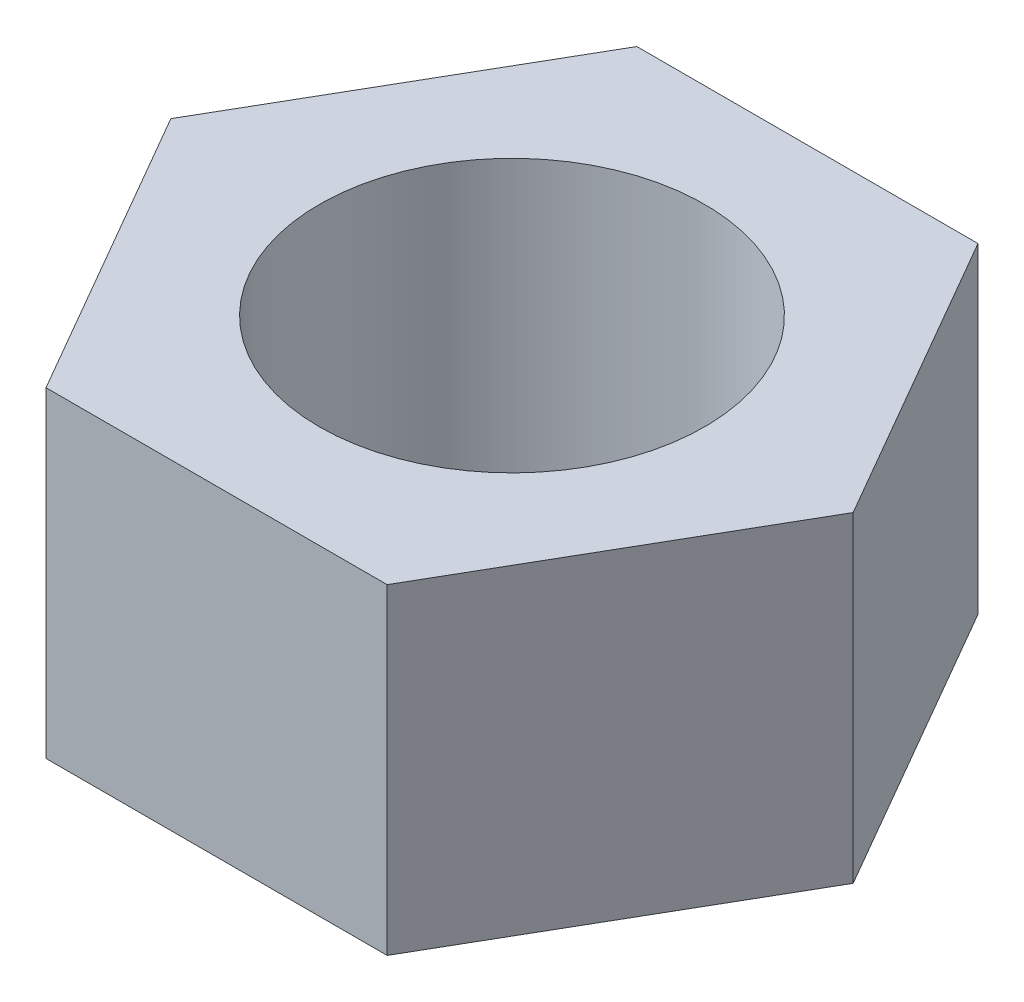
ISO-10303-21;
HEADER;
FILE_DESCRIPTION(('STEP AP214'),'2;1');
FILE_NAME('part.step','',(''),(''),'','','');
FILE_SCHEMA(('AUTOMOTIVE_DESIGN { 1 0 10303 214 1 1 1 1 }'));
ENDSEC;
DATA;
#1=APPLICATION_CONTEXT('core data for automotive mechanical design processes');
#2=APPLICATION_PROTOCOL_DEFINITION('international standard','automotive_design',2000,#1);
#3=PRODUCT_CONTEXT('',#1,'mechanical');
#4=PRODUCT('Part','Part','',(#3));
#5=PRODUCT_RELATED_PRODUCT_CATEGORY('part','',(#4));
#6=PRODUCT_DEFINITION_FORMATION('','',#4);
#7=PRODUCT_DEFINITION_CONTEXT('part definition',#1,'design');
#8=PRODUCT_DEFINITION('design','',#6,#7);
#9=PRODUCT_DEFINITION_SHAPE('','',#8);
#10=(LENGTH_UNIT() NAMED_UNIT(*) SI_UNIT(.MILLI.,.METRE.));
#11=(NAMED_UNIT(*) PLANE_ANGLE_UNIT() SI_UNIT($,.RADIAN.));
#12=(NAMED_UNIT(*) SI_UNIT($,.STERADIAN.) SOLID_ANGLE_UNIT());
#13=UNCERTAINTY_MEASURE_WITH_UNIT(LENGTH_MEASURE(1.E-05),#10,'distance_accuracy_value','');
#14=(GEOMETRIC_REPRESENTATION_CONTEXT(3) GLOBAL_UNCERTAINTY_ASSIGNED_CONTEXT((#13)) GLOBAL_UNIT_ASSIGNED_CONTEXT((#10,
#11,#12)) REPRESENTATION_CONTEXT('',''));
#15=CARTESIAN_POINT('',(0.,0.,0.));
#16=DIRECTION('',(0.,0.,1.));
#17=DIRECTION('',(1.,0.,0.));
#18=AXIS2_PLACEMENT_3D('',#15,#16,#17);
#19=CARTESIAN_POINT('',(-1.99185842870421,2.5,1.15));
#20=DIRECTION('',(0.866025403784439,0.,-0.5));
#21=DIRECTION('',(-0.5,0.,-0.866025403784439));
#22=AXIS2_PLACEMENT_3D('',#19,#20,#21);
#23=PLANE('',#22);
#24=DIRECTION('',(0.5,0.,0.866025403784439));
#25=VECTOR('',#24,1.);
#26=CARTESIAN_POINT('',(-1.99185842870421,0.,1.15));
#27=LINE('',#26,#25);
#28=CARTESIAN_POINT('',(-2.65581123827228,0.,0.));
#29=VERTEX_POINT('',#28);
#30=CARTESIAN_POINT('',(-1.32790561913614,0.,2.3));
#31=VERTEX_POINT('',#30);
#32=EDGE_CURVE('E125',#29,#31,#27,.T.);
#33=ORIENTED_EDGE('',*,*,#32,.T.);
#34=DIRECTION('',(0.,-1.,0.));
#35=VECTOR('',#34,1.);
#36=CARTESIAN_POINT('',(-1.32790561913614,2.5,2.3));
#37=LINE('',#36,#35);
#38=CARTESIAN_POINT('',(-1.32790561913614,2.5,2.3));
#39=VERTEX_POINT('',#38);
#40=EDGE_CURVE('E11',#39,#31,#37,.T.);
#41=ORIENTED_EDGE('',*,*,#40,.F.);
#42=DIRECTION('',(0.5,0.,0.866025403784439));
#43=VECTOR('',#42,1.);
#44=CARTESIAN_POINT('',(-1.99185842870421,2.5,1.15));
#45=LINE('',#44,#43);
#46=CARTESIAN_POINT('',(-2.65581123827228,2.5,0.));
#47=VERTEX_POINT('',#46);
#48=EDGE_CURVE('E148',#47,#39,#45,.T.);
#49=ORIENTED_EDGE('',*,*,#48,.F.);
#50=DIRECTION('',(0.,-1.,0.));
#51=VECTOR('',#50,1.);
#52=CARTESIAN_POINT('',(-2.65581123827228,2.5,0.));
#53=LINE('',#52,#51);
#54=EDGE_CURVE('E118',#47,#29,#53,.T.);
#55=ORIENTED_EDGE('',*,*,#54,.T.);
#56=EDGE_LOOP('',(#33,#41,#49,#55));
#57=FACE_BOUND('',#56,.T.);
#58=ADVANCED_FACE('F37',(#57),#23,.F.);
#59=CARTESIAN_POINT('',(0.,2.5,2.3));
#60=DIRECTION('',(0.,0.,-1.));
#61=DIRECTION('',(-1.,0.,0.));
#62=AXIS2_PLACEMENT_3D('',#59,#60,#61);
#63=PLANE('',#62);
#64=DIRECTION('',(1.,0.,0.));
#65=VECTOR('',#64,1.);
#66=CARTESIAN_POINT('',(0.,0.,2.3));
#67=LINE('',#66,#65);
#68=CARTESIAN_POINT('',(1.32790561913614,0.,2.3));
#69=VERTEX_POINT('',#68);
#70=EDGE_CURVE('E128',#31,#69,#67,.T.);
#71=ORIENTED_EDGE('',*,*,#70,.T.);
#72=DIRECTION('',(0.,-1.,0.));
#73=VECTOR('',#72,1.);
#74=CARTESIAN_POINT('',(1.32790561913614,2.5,2.3));
#75=LINE('',#74,#73);
#76=CARTESIAN_POINT('',(1.32790561913614,2.5,2.3));
#77=VERTEX_POINT('',#76);
#78=EDGE_CURVE('E46',#77,#69,#75,.T.);
#79=ORIENTED_EDGE('',*,*,#78,.F.);
#80=DIRECTION('',(1.,0.,0.));
#81=VECTOR('',#80,1.);
#82=CARTESIAN_POINT('',(0.,2.5,2.3));
#83=LINE('',#82,#81);
#84=EDGE_CURVE('E91',#39,#77,#83,.T.);
#85=ORIENTED_EDGE('',*,*,#84,.F.);
#86=ORIENTED_EDGE('',*,*,#40,.T.);
#87=EDGE_LOOP('',(#71,#79,#85,#86));
#88=FACE_BOUND('',#87,.T.);
#89=ADVANCED_FACE('F162',(#88),#63,.F.);
#90=CARTESIAN_POINT('',(1.99185842870421,2.5,1.15));
#91=DIRECTION('',(-0.866025403784438,0.,-0.5));
#92=DIRECTION('',(-0.5,0.,0.866025403784438));
#93=AXIS2_PLACEMENT_3D('',#90,#91,#92);
#94=PLANE('',#93);
#95=DIRECTION('',(0.5,0.,-0.866025403784439));
#96=VECTOR('',#95,1.);
#97=CARTESIAN_POINT('',(1.99185842870421,0.,1.15));
#98=LINE('',#97,#96);
#99=CARTESIAN_POINT('',(2.65581123827228,0.,0.));
#100=VERTEX_POINT('',#99);
#101=EDGE_CURVE('E130',#69,#100,#98,.T.);
#102=ORIENTED_EDGE('',*,*,#101,.T.);
#103=DIRECTION('',(0.,-1.,0.));
#104=VECTOR('',#103,1.);
#105=CARTESIAN_POINT('',(2.65581123827228,2.5,0.));
#106=LINE('',#105,#104);
#107=CARTESIAN_POINT('',(2.65581123827228,2.5,0.));
#108=VERTEX_POINT('',#107);
#109=EDGE_CURVE('E113',#108,#100,#106,.T.);
#110=ORIENTED_EDGE('',*,*,#109,.F.);
#111=DIRECTION('',(0.5,0.,-0.866025403784439));
#112=VECTOR('',#111,1.);
#113=CARTESIAN_POINT('',(1.99185842870421,2.5,1.15));
#114=LINE('',#113,#112);
#115=EDGE_CURVE('E104',#77,#108,#114,.T.);
#116=ORIENTED_EDGE('',*,*,#115,.F.);
#117=ORIENTED_EDGE('',*,*,#78,.T.);
#118=EDGE_LOOP('',(#102,#110,#116,#117));
#119=FACE_BOUND('',#118,.T.);
#120=ADVANCED_FACE('F141',(#119),#94,.F.);
#121=CARTESIAN_POINT('',(1.99185842870421,2.5,-1.15));
#122=DIRECTION('',(-0.866025403784439,0.,0.5));
#123=DIRECTION('',(0.5,0.,0.866025403784439));
#124=AXIS2_PLACEMENT_3D('',#121,#122,#123);
#125=PLANE('',#124);
#126=DIRECTION('',(-0.5,0.,-0.866025403784439));
#127=VECTOR('',#126,1.);
#128=CARTESIAN_POINT('',(1.99185842870421,0.,-1.15));
#129=LINE('',#128,#127);
#130=CARTESIAN_POINT('',(1.32790561913614,0.,-2.3));
#131=VERTEX_POINT('',#130);
#132=EDGE_CURVE('E112',#100,#131,#129,.T.);
#133=ORIENTED_EDGE('',*,*,#132,.T.);
#134=DIRECTION('',(0.,-1.,0.));
#135=VECTOR('',#134,1.);
#136=CARTESIAN_POINT('',(1.32790561913614,2.5,-2.3));
#137=LINE('',#136,#135);
#138=CARTESIAN_POINT('',(1.32790561913614,2.5,-2.3));
#139=VERTEX_POINT('',#138);
#140=EDGE_CURVE('E109',#139,#131,#137,.T.);
#141=ORIENTED_EDGE('',*,*,#140,.F.);
#142=DIRECTION('',(-0.5,0.,-0.866025403784439));
#143=VECTOR('',#142,1.);
#144=CARTESIAN_POINT('',(1.99185842870421,2.5,-1.15));
#145=LINE('',#144,#143);
#146=EDGE_CURVE('E98',#108,#139,#145,.T.);
#147=ORIENTED_EDGE('',*,*,#146,.F.);
#148=ORIENTED_EDGE('',*,*,#109,.T.);
#149=EDGE_LOOP('',(#133,#141,#147,#148));
#150=FACE_BOUND('',#149,.T.);
#151=ADVANCED_FACE('F110',(#150),#125,.F.);
#152=CARTESIAN_POINT('',(0.,2.5,-2.3));
#153=DIRECTION('',(0.,0.,1.));
#154=DIRECTION('',(1.,0.,0.));
#155=AXIS2_PLACEMENT_3D('',#152,#153,#154);
#156=PLANE('',#155);
#157=DIRECTION('',(-1.,0.,0.));
#158=VECTOR('',#157,1.);
#159=CARTESIAN_POINT('',(0.,0.,-2.3));
#160=LINE('',#159,#158);
#161=CARTESIAN_POINT('',(-1.32790561913614,0.,-2.3));
#162=VERTEX_POINT('',#161);
#163=EDGE_CURVE('E77',#131,#162,#160,.T.);
#164=ORIENTED_EDGE('',*,*,#163,.T.);
#165=DIRECTION('',(0.,-1.,0.));
#166=VECTOR('',#165,1.);
#167=CARTESIAN_POINT('',(-1.32790561913614,2.5,-2.3));
#168=LINE('',#167,#166);
#169=CARTESIAN_POINT('',(-1.32790561913614,2.5,-2.3));
#170=VERTEX_POINT('',#169);
#171=EDGE_CURVE('E114',#170,#162,#168,.T.);
#172=ORIENTED_EDGE('',*,*,#171,.F.);
#173=DIRECTION('',(-1.,0.,0.));
#174=VECTOR('',#173,1.);
#175=CARTESIAN_POINT('',(0.,2.5,-2.3));
#176=LINE('',#175,#174);
#177=EDGE_CURVE('E102',#139,#170,#176,.T.);
#178=ORIENTED_EDGE('',*,*,#177,.F.);
#179=ORIENTED_EDGE('',*,*,#140,.T.);
#180=EDGE_LOOP('',(#164,#172,#178,#179));
#181=FACE_BOUND('',#180,.T.);
#182=ADVANCED_FACE('F116',(#181),#156,.F.);
#183=CARTESIAN_POINT('',(0.,2.5,0.));
#184=DIRECTION('',(0.,-1.,0.));
#185=DIRECTION('',(0.,0.,-1.));
#186=AXIS2_PLACEMENT_3D('',#183,#184,#185);
#187=CYLINDRICAL_SURFACE('',#186,1.5);
#188=CARTESIAN_POINT('',(0.,2.5,0.));
#189=DIRECTION('',(0.,1.,0.));
#190=DIRECTION('',(0.,0.,1.));
#191=AXIS2_PLACEMENT_3D('',#188,#189,#190);
#192=CIRCLE('',#191,1.5);
#193=CARTESIAN_POINT('',(0.,2.5,1.5));
#194=VERTEX_POINT('',#193);
#195=EDGE_CURVE('E135',#194,#194,#192,.T.);
#196=ORIENTED_EDGE('',*,*,#195,.T.);
#197=EDGE_LOOP('',(#196));
#198=FACE_BOUND('',#197,.T.);
#199=CARTESIAN_POINT('',(0.,0.,0.));
#200=DIRECTION('',(0.,1.,0.));
#201=DIRECTION('',(0.,0.,1.));
#202=AXIS2_PLACEMENT_3D('',#199,#200,#201);
#203=CIRCLE('',#202,1.5);
#204=CARTESIAN_POINT('',(0.,0.,1.5));
#205=VERTEX_POINT('',#204);
#206=EDGE_CURVE('E122',#205,#205,#203,.T.);
#207=ORIENTED_EDGE('',*,*,#206,.F.);
#208=EDGE_LOOP('',(#207));
#209=FACE_BOUND('',#208,.T.);
#210=ADVANCED_FACE('F39',(#198,#209),#187,.F.);
#211=CARTESIAN_POINT('',(-1.99185842870421,2.5,-1.15));
#212=DIRECTION('',(0.866025403784439,0.,0.5));
#213=DIRECTION('',(0.5,0.,-0.866025403784439));
#214=AXIS2_PLACEMENT_3D('',#211,#212,#213);
#215=PLANE('',#214);
#216=DIRECTION('',(-0.5,0.,0.866025403784439));
#217=VECTOR('',#216,1.);
#218=CARTESIAN_POINT('',(-1.99185842870421,0.,-1.15));
#219=LINE('',#218,#217);
#220=EDGE_CURVE('E83',#162,#29,#219,.T.);
#221=ORIENTED_EDGE('',*,*,#220,.T.);
#222=ORIENTED_EDGE('',*,*,#54,.F.);
#223=DIRECTION('',(-0.5,0.,0.866025403784439));
#224=VECTOR('',#223,1.);
#225=CARTESIAN_POINT('',(-1.99185842870421,2.5,-1.15));
#226=LINE('',#225,#224);
#227=EDGE_CURVE('E54',#170,#47,#226,.T.);
#228=ORIENTED_EDGE('',*,*,#227,.F.);
#229=ORIENTED_EDGE('',*,*,#171,.T.);
#230=EDGE_LOOP('',(#221,#222,#228,#229));
#231=FACE_BOUND('',#230,.T.);
#232=ADVANCED_FACE('F149',(#231),#215,.F.);
#233=CARTESIAN_POINT('',(0.,2.5,0.));
#234=DIRECTION('',(0.,1.,0.));
#235=DIRECTION('',(0.,0.,1.));
#236=AXIS2_PLACEMENT_3D('',#233,#234,#235);
#237=PLANE('',#236);
#238=ORIENTED_EDGE('',*,*,#195,.F.);
#239=EDGE_LOOP('',(#238));
#240=FACE_BOUND('',#239,.T.);
#241=ORIENTED_EDGE('',*,*,#48,.T.);
#242=ORIENTED_EDGE('',*,*,#84,.T.);
#243=ORIENTED_EDGE('',*,*,#115,.T.);
#244=ORIENTED_EDGE('',*,*,#146,.T.);
#245=ORIENTED_EDGE('',*,*,#177,.T.);
#246=ORIENTED_EDGE('',*,*,#227,.T.);
#247=EDGE_LOOP('',(#241,#242,#243,#244,#245,#246));
#248=FACE_BOUND('',#247,.T.);
#249=ADVANCED_FACE('F100',(#240,#248),#237,.T.);
#250=CARTESIAN_POINT('',(0.,0.,0.));
#251=DIRECTION('',(0.,1.,0.));
#252=DIRECTION('',(0.,0.,1.));
#253=AXIS2_PLACEMENT_3D('',#250,#251,#252);
#254=PLANE('',#253);
#255=ORIENTED_EDGE('',*,*,#206,.T.);
#256=EDGE_LOOP('',(#255));
#257=FACE_BOUND('',#256,.T.);
#258=ORIENTED_EDGE('',*,*,#32,.F.);
#259=ORIENTED_EDGE('',*,*,#220,.F.);
#260=ORIENTED_EDGE('',*,*,#163,.F.);
#261=ORIENTED_EDGE('',*,*,#132,.F.);
#262=ORIENTED_EDGE('',*,*,#101,.F.);
#263=ORIENTED_EDGE('',*,*,#70,.F.);
#264=EDGE_LOOP('',(#258,#259,#260,#261,#262,#263));
#265=FACE_BOUND('',#264,.T.);
#266=ADVANCED_FACE('F144',(#257,#265),#254,.F.);
#267=CLOSED_SHELL('',(#58,#89,#120,#151,#182,#210,#232,#249,#266));
#268=MANIFOLD_SOLID_BREP('B2',#267);
#269=ADVANCED_BREP_SHAPE_REPRESENTATION('',(#18,#268),#14);
#270=SHAPE_DEFINITION_REPRESENTATION(#9,#269);
ENDSEC;
END-ISO-10303-21;
